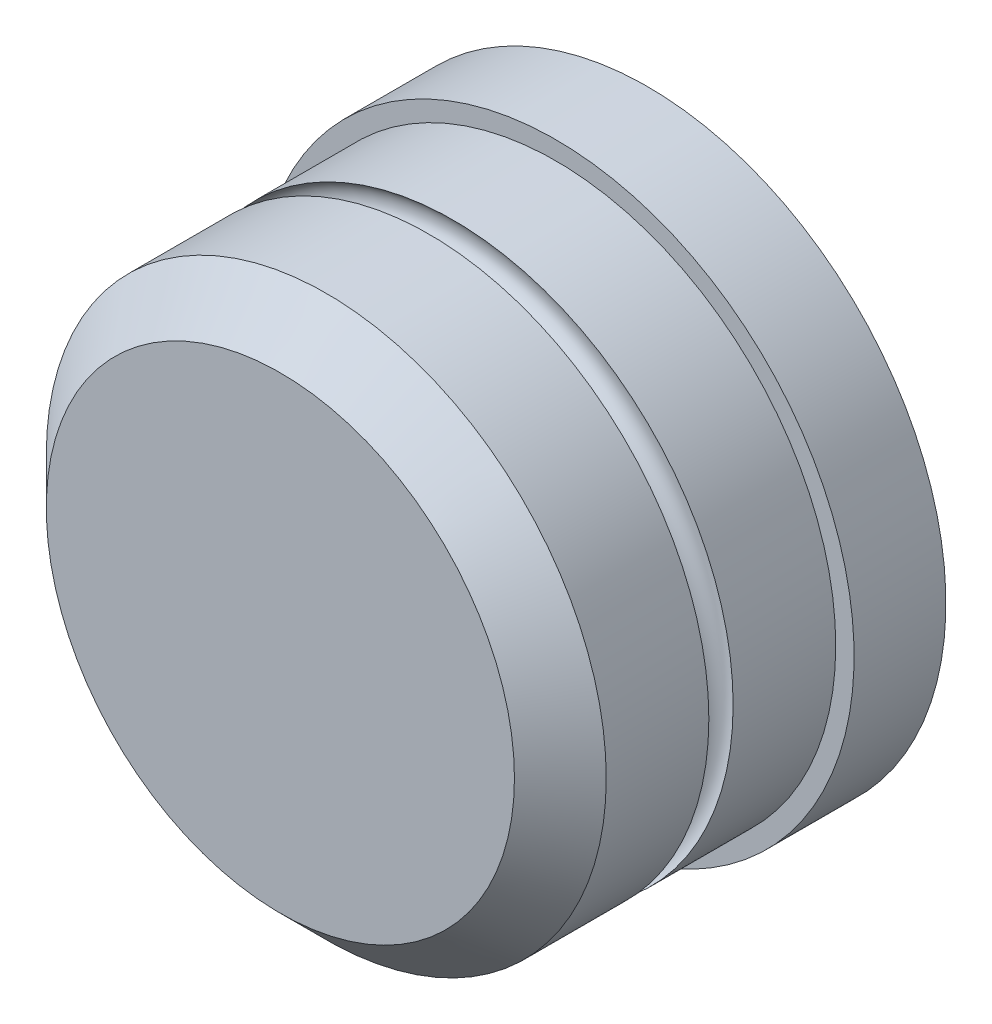
ISO-10303-21;
HEADER;
FILE_DESCRIPTION(('STEP AP214'),'2;1');
FILE_NAME('part.step','',(''),(''),'','','');
FILE_SCHEMA(('AUTOMOTIVE_DESIGN { 1 0 10303 214 1 1 1 1 }'));
ENDSEC;
DATA;
#1=APPLICATION_CONTEXT('core data for automotive mechanical design processes');
#2=APPLICATION_PROTOCOL_DEFINITION('international standard','automotive_design',2000,#1);
#3=PRODUCT_CONTEXT('',#1,'mechanical');
#4=PRODUCT('Part','Part','',(#3));
#5=PRODUCT_RELATED_PRODUCT_CATEGORY('part','',(#4));
#6=PRODUCT_DEFINITION_FORMATION('','',#4);
#7=PRODUCT_DEFINITION_CONTEXT('part definition',#1,'design');
#8=PRODUCT_DEFINITION('design','',#6,#7);
#9=PRODUCT_DEFINITION_SHAPE('','',#8);
#10=(LENGTH_UNIT() NAMED_UNIT(*) SI_UNIT(.MILLI.,.METRE.));
#11=(NAMED_UNIT(*) PLANE_ANGLE_UNIT() SI_UNIT($,.RADIAN.));
#12=(NAMED_UNIT(*) SI_UNIT($,.STERADIAN.) SOLID_ANGLE_UNIT());
#13=UNCERTAINTY_MEASURE_WITH_UNIT(LENGTH_MEASURE(1.E-05),#10,'distance_accuracy_value','');
#14=(GEOMETRIC_REPRESENTATION_CONTEXT(3) GLOBAL_UNCERTAINTY_ASSIGNED_CONTEXT((#13)) GLOBAL_UNIT_ASSIGNED_CONTEXT((#10,
#11,#12)) REPRESENTATION_CONTEXT('',''));
#15=CARTESIAN_POINT('',(0.,0.,0.));
#16=DIRECTION('',(0.,0.,1.));
#17=DIRECTION('',(1.,0.,0.));
#18=AXIS2_PLACEMENT_3D('',#15,#16,#17);
#19=CARTESIAN_POINT('',(0.,0.,30.));
#20=DIRECTION('',(0.,0.,-1.));
#21=DIRECTION('',(-1.,0.,0.));
#22=AXIS2_PLACEMENT_3D('',#19,#20,#21);
#23=CYLINDRICAL_SURFACE('',#22,30.5);
#24=CARTESIAN_POINT('',(0.,0.,0.));
#25=DIRECTION('',(0.,0.,1.));
#26=DIRECTION('',(1.,0.,0.));
#27=AXIS2_PLACEMENT_3D('',#24,#25,#26);
#28=CIRCLE('',#27,30.5);
#29=CARTESIAN_POINT('',(30.5,0.,0.));
#30=VERTEX_POINT('',#29);
#31=EDGE_CURVE('E65',#30,#30,#28,.T.);
#32=ORIENTED_EDGE('',*,*,#31,.T.);
#33=EDGE_LOOP('',(#32));
#34=FACE_BOUND('',#33,.T.);
#35=CARTESIAN_POINT('',(0.,0.,11.1771243444677));
#36=DIRECTION('',(0.,0.,1.));
#37=DIRECTION('',(1.,0.,0.));
#38=AXIS2_PLACEMENT_3D('',#35,#36,#37);
#39=CIRCLE('',#38,30.5);
#40=CARTESIAN_POINT('',(-30.5,0.,11.1771243444677));
#41=VERTEX_POINT('',#40);
#42=EDGE_CURVE('E48',#41,#41,#39,.T.);
#43=ORIENTED_EDGE('',*,*,#42,.F.);
#44=EDGE_LOOP('',(#43));
#45=FACE_BOUND('',#44,.T.);
#46=ADVANCED_FACE('F39',(#34,#45),#23,.T.);
#47=CARTESIAN_POINT('',(0.,0.,-10.));
#48=DIRECTION('',(0.,0.,1.));
#49=DIRECTION('',(1.,0.,0.));
#50=AXIS2_PLACEMENT_3D('',#47,#48,#49);
#51=CYLINDRICAL_SURFACE('',#50,32.5);
#52=CARTESIAN_POINT('',(0.,0.,-10.));
#53=DIRECTION('',(0.,0.,-1.));
#54=DIRECTION('',(-1.,0.,0.));
#55=AXIS2_PLACEMENT_3D('',#52,#53,#54);
#56=CIRCLE('',#55,32.5);
#57=CARTESIAN_POINT('',(-32.5,0.,-10.));
#58=VERTEX_POINT('',#57);
#59=EDGE_CURVE('E61',#58,#58,#56,.T.);
#60=ORIENTED_EDGE('',*,*,#59,.F.);
#61=EDGE_LOOP('',(#60));
#62=FACE_BOUND('',#61,.T.);
#63=CARTESIAN_POINT('',(0.,0.,0.));
#64=DIRECTION('',(0.,0.,-1.));
#65=DIRECTION('',(-1.,0.,0.));
#66=AXIS2_PLACEMENT_3D('',#63,#64,#65);
#67=CIRCLE('',#66,32.5);
#68=CARTESIAN_POINT('',(-32.5,0.,0.));
#69=VERTEX_POINT('',#68);
#70=EDGE_CURVE('E58',#69,#69,#67,.T.);
#71=ORIENTED_EDGE('',*,*,#70,.T.);
#72=EDGE_LOOP('',(#71));
#73=FACE_BOUND('',#72,.T.);
#74=ADVANCED_FACE('F93',(#62,#73),#51,.T.);
#75=CARTESIAN_POINT('',(0.,0.,-10.));
#76=DIRECTION('',(0.,0.,-1.));
#77=DIRECTION('',(-1.,0.,0.));
#78=AXIS2_PLACEMENT_3D('',#75,#76,#77);
#79=PLANE('',#78);
#80=ORIENTED_EDGE('',*,*,#59,.T.);
#81=EDGE_LOOP('',(#80));
#82=FACE_BOUND('',#81,.T.);
#83=ADVANCED_FACE('F98',(#82),#79,.T.);
#84=CARTESIAN_POINT('',(0.,0.,0.));
#85=DIRECTION('',(0.,0.,-1.));
#86=DIRECTION('',(-1.,0.,0.));
#87=AXIS2_PLACEMENT_3D('',#84,#85,#86);
#88=PLANE('',#87);
#89=ORIENTED_EDGE('',*,*,#31,.F.);
#90=EDGE_LOOP('',(#89));
#91=FACE_BOUND('',#90,.T.);
#92=ORIENTED_EDGE('',*,*,#70,.F.);
#93=EDGE_LOOP('',(#92));
#94=FACE_BOUND('',#93,.T.);
#95=ADVANCED_FACE('F89',(#91,#94),#88,.F.);
#96=CARTESIAN_POINT('',(0.,0.,12.5));
#97=DIRECTION('',(0.,0.,1.));
#98=DIRECTION('',(1.,0.,0.));
#99=AXIS2_PLACEMENT_3D('',#96,#97,#98);
#100=TOROIDAL_SURFACE('',#99,29.,2.);
#101=CARTESIAN_POINT('',(0.,0.,13.8228756555323));
#102=DIRECTION('',(0.,0.,-1.));
#103=DIRECTION('',(-1.,0.,0.));
#104=AXIS2_PLACEMENT_3D('',#101,#102,#103);
#105=CIRCLE('',#104,30.5);
#106=CARTESIAN_POINT('',(-30.5,0.,13.8228756555323));
#107=VERTEX_POINT('',#106);
#108=EDGE_CURVE('E11',#107,#107,#105,.T.);
#109=ORIENTED_EDGE('',*,*,#108,.T.);
#110=CARTESIAN_POINT('',(-29.,0.,12.5));
#111=DIRECTION('',(0.,1.,0.));
#112=DIRECTION('',(0.,0.,1.));
#113=AXIS2_PLACEMENT_3D('',#110,#111,#112);
#114=CIRCLE('',#113,2.);
#115=EDGE_CURVE('E54',#107,#41,#114,.T.);
#116=ORIENTED_EDGE('',*,*,#115,.T.);
#117=ORIENTED_EDGE('',*,*,#42,.T.);
#118=ORIENTED_EDGE('',*,*,#115,.F.);
#119=EDGE_LOOP('',(#109,#116,#117,#118));
#120=FACE_BOUND('',#119,.T.);
#121=ADVANCED_FACE('F55',(#120),#100,.F.);
#122=CARTESIAN_POINT('',(0.,0.,30.));
#123=DIRECTION('',(0.,0.,1.));
#124=DIRECTION('',(1.,0.,0.));
#125=AXIS2_PLACEMENT_3D('',#122,#123,#124);
#126=PLANE('',#125);
#127=CARTESIAN_POINT('',(0.,0.,30.));
#128=DIRECTION('',(0.,0.,1.));
#129=DIRECTION('',(1.,0.,0.));
#130=AXIS2_PLACEMENT_3D('',#127,#128,#129);
#131=CIRCLE('',#130,25.5);
#132=CARTESIAN_POINT('',(25.5,0.,30.));
#133=VERTEX_POINT('',#132);
#134=EDGE_CURVE('E69',#133,#133,#131,.T.);
#135=ORIENTED_EDGE('',*,*,#134,.T.);
#136=EDGE_LOOP('',(#135));
#137=FACE_BOUND('',#136,.T.);
#138=ADVANCED_FACE('F81',(#137),#126,.T.);
#139=CARTESIAN_POINT('',(0.,0.,30.));
#140=DIRECTION('',(0.,0.,-1.));
#141=DIRECTION('',(-1.,0.,0.));
#142=AXIS2_PLACEMENT_3D('',#139,#140,#141);
#143=CONICAL_SURFACE('',#142,25.5,0.785398163397447);
#144=CARTESIAN_POINT('',(0.,0.,25.));
#145=DIRECTION('',(0.,0.,1.));
#146=DIRECTION('',(1.,0.,0.));
#147=AXIS2_PLACEMENT_3D('',#144,#145,#146);
#148=CIRCLE('',#147,30.5);
#149=CARTESIAN_POINT('',(30.5,0.,25.));
#150=VERTEX_POINT('',#149);
#151=EDGE_CURVE('E72',#150,#150,#148,.F.);
#152=ORIENTED_EDGE('',*,*,#151,.F.);
#153=EDGE_LOOP('',(#152));
#154=FACE_BOUND('',#153,.T.);
#155=ORIENTED_EDGE('',*,*,#134,.F.);
#156=EDGE_LOOP('',(#155));
#157=FACE_BOUND('',#156,.T.);
#158=ADVANCED_FACE('F42',(#154,#157),#143,.T.);
#159=ORIENTED_EDGE('',*,*,#151,.T.);
#160=EDGE_LOOP('',(#159));
#161=FACE_BOUND('',#160,.T.);
#162=ORIENTED_EDGE('',*,*,#108,.F.);
#163=EDGE_LOOP('',(#162));
#164=FACE_BOUND('',#163,.T.);
#165=ADVANCED_FACE('F76',(#161,#164),#23,.T.);
#166=CLOSED_SHELL('',(#46,#74,#83,#95,#121,#138,#158,#165));
#167=MANIFOLD_SOLID_BREP('B2',#166);
#168=ADVANCED_BREP_SHAPE_REPRESENTATION('',(#18,#167),#14);
#169=SHAPE_DEFINITION_REPRESENTATION(#9,#168);
ENDSEC;
END-ISO-10303-21;
